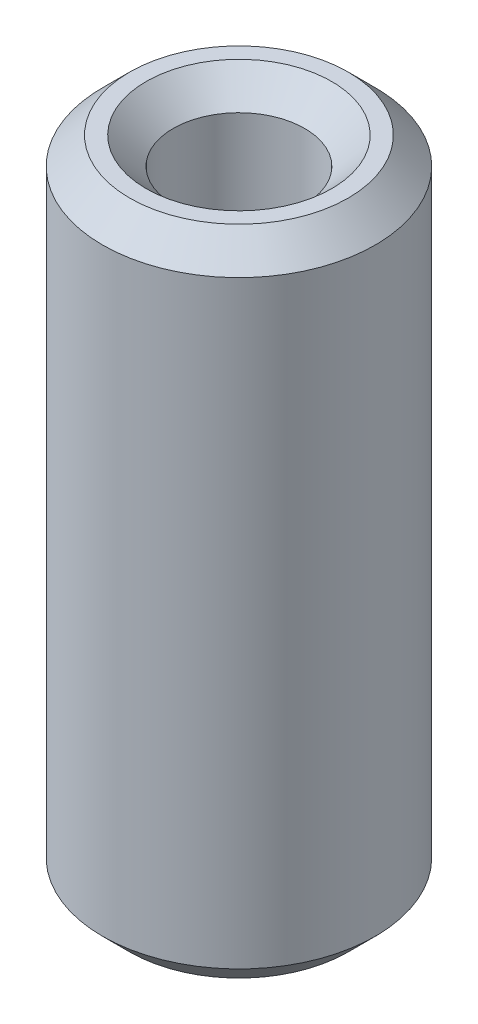
ISO-10303-21;
HEADER;
FILE_DESCRIPTION(('STEP AP214'),'2;1');
FILE_NAME('part.step','',(''),(''),'','','');
FILE_SCHEMA(('AUTOMOTIVE_DESIGN { 1 0 10303 214 1 1 1 1 }'));
ENDSEC;
DATA;
#1=APPLICATION_CONTEXT('core data for automotive mechanical design processes');
#2=APPLICATION_PROTOCOL_DEFINITION('international standard','automotive_design',2000,#1);
#3=PRODUCT_CONTEXT('',#1,'mechanical');
#4=PRODUCT('Part','Part','',(#3));
#5=PRODUCT_RELATED_PRODUCT_CATEGORY('part','',(#4));
#6=PRODUCT_DEFINITION_FORMATION('','',#4);
#7=PRODUCT_DEFINITION_CONTEXT('part definition',#1,'design');
#8=PRODUCT_DEFINITION('design','',#6,#7);
#9=PRODUCT_DEFINITION_SHAPE('','',#8);
#10=(LENGTH_UNIT() NAMED_UNIT(*) SI_UNIT(.MILLI.,.METRE.));
#11=(NAMED_UNIT(*) PLANE_ANGLE_UNIT() SI_UNIT($,.RADIAN.));
#12=(NAMED_UNIT(*) SI_UNIT($,.STERADIAN.) SOLID_ANGLE_UNIT());
#13=UNCERTAINTY_MEASURE_WITH_UNIT(LENGTH_MEASURE(1.E-05),#10,'distance_accuracy_value','');
#14=(GEOMETRIC_REPRESENTATION_CONTEXT(3) GLOBAL_UNCERTAINTY_ASSIGNED_CONTEXT((#13)) GLOBAL_UNIT_ASSIGNED_CONTEXT((#10,
#11,#12)) REPRESENTATION_CONTEXT('',''));
#15=CARTESIAN_POINT('',(0.,0.,0.));
#16=DIRECTION('',(0.,0.,1.));
#17=DIRECTION('',(1.,0.,0.));
#18=AXIS2_PLACEMENT_3D('',#15,#16,#17);
#19=CARTESIAN_POINT('',(0.,47.8930328423497,0.));
#20=DIRECTION('',(0.,-1.,0.));
#21=DIRECTION('',(0.,0.,-1.));
#22=AXIS2_PLACEMENT_3D('',#19,#20,#21);
#23=CYLINDRICAL_SURFACE('',#22,10.);
#24=CARTESIAN_POINT('',(0.,1.98736355204662,0.));
#25=DIRECTION('',(0.,1.,0.));
#26=DIRECTION('',(0.,0.,1.));
#27=AXIS2_PLACEMENT_3D('',#24,#25,#26);
#28=CIRCLE('',#27,10.);
#29=CARTESIAN_POINT('',(0.,1.98736355204662,10.));
#30=VERTEX_POINT('',#29);
#31=EDGE_CURVE('E10',#30,#30,#28,.T.);
#32=ORIENTED_EDGE('',*,*,#31,.T.);
#33=EDGE_LOOP('',(#32));
#34=FACE_BOUND('',#33,.T.);
#35=CARTESIAN_POINT('',(0.,45.9056692903031,0.));
#36=DIRECTION('',(0.,1.,0.));
#37=DIRECTION('',(0.,0.,1.));
#38=AXIS2_PLACEMENT_3D('',#35,#36,#37);
#39=CIRCLE('',#38,10.);
#40=CARTESIAN_POINT('',(0.,45.9056692903031,10.));
#41=VERTEX_POINT('',#40);
#42=EDGE_CURVE('E50',#41,#41,#39,.F.);
#43=ORIENTED_EDGE('',*,*,#42,.T.);
#44=EDGE_LOOP('',(#43));
#45=FACE_BOUND('',#44,.T.);
#46=ADVANCED_FACE('F39',(#34,#45),#23,.T.);
#47=CARTESIAN_POINT('',(0.,47.8930328423497,0.));
#48=DIRECTION('',(0.,1.,0.));
#49=DIRECTION('',(0.,0.,1.));
#50=AXIS2_PLACEMENT_3D('',#47,#48,#49);
#51=PLANE('',#50);
#52=CARTESIAN_POINT('',(0.,47.8930328423497,0.));
#53=DIRECTION('',(0.,1.,0.));
#54=DIRECTION('',(0.,0.,1.));
#55=AXIS2_PLACEMENT_3D('',#52,#53,#54);
#56=CIRCLE('',#55,6.80934280985178);
#57=CARTESIAN_POINT('',(0.,47.8930328423497,6.80934280985178));
#58=VERTEX_POINT('',#57);
#59=EDGE_CURVE('E58',#58,#58,#56,.F.);
#60=ORIENTED_EDGE('',*,*,#59,.T.);
#61=EDGE_LOOP('',(#60));
#62=FACE_BOUND('',#61,.T.);
#63=CARTESIAN_POINT('',(0.,47.8930328423497,0.));
#64=DIRECTION('',(0.,1.,0.));
#65=DIRECTION('',(0.,0.,1.));
#66=AXIS2_PLACEMENT_3D('',#63,#64,#65);
#67=CIRCLE('',#66,8.01263644795339);
#68=CARTESIAN_POINT('',(0.,47.8930328423497,8.01263644795339));
#69=VERTEX_POINT('',#68);
#70=EDGE_CURVE('E61',#69,#69,#67,.T.);
#71=ORIENTED_EDGE('',*,*,#70,.T.);
#72=EDGE_LOOP('',(#71));
#73=FACE_BOUND('',#72,.T.);
#74=ADVANCED_FACE('F88',(#62,#73),#51,.T.);
#75=CARTESIAN_POINT('',(0.,0.,0.));
#76=DIRECTION('',(0.,1.,0.));
#77=DIRECTION('',(0.,0.,1.));
#78=AXIS2_PLACEMENT_3D('',#75,#76,#77);
#79=PLANE('',#78);
#80=CARTESIAN_POINT('',(0.,0.,0.));
#81=DIRECTION('',(0.,1.,0.));
#82=DIRECTION('',(0.,0.,1.));
#83=AXIS2_PLACEMENT_3D('',#80,#81,#82);
#84=CIRCLE('',#83,6.80934280985177);
#85=CARTESIAN_POINT('',(0.,0.,6.80934280985177));
#86=VERTEX_POINT('',#85);
#87=EDGE_CURVE('E51',#86,#86,#84,.T.);
#88=ORIENTED_EDGE('',*,*,#87,.T.);
#89=EDGE_LOOP('',(#88));
#90=FACE_BOUND('',#89,.T.);
#91=CARTESIAN_POINT('',(0.,0.,0.));
#92=DIRECTION('',(0.,1.,0.));
#93=DIRECTION('',(0.,0.,1.));
#94=AXIS2_PLACEMENT_3D('',#91,#92,#93);
#95=CIRCLE('',#94,8.01263644795337);
#96=CARTESIAN_POINT('',(0.,0.,8.01263644795337));
#97=VERTEX_POINT('',#96);
#98=EDGE_CURVE('E54',#97,#97,#95,.F.);
#99=ORIENTED_EDGE('',*,*,#98,.T.);
#100=EDGE_LOOP('',(#99));
#101=FACE_BOUND('',#100,.T.);
#102=ADVANCED_FACE('F83',(#90,#101),#79,.F.);
#103=CARTESIAN_POINT('',(0.,47.8930328423497,0.));
#104=DIRECTION('',(0.,-1.,0.));
#105=DIRECTION('',(0.,0.,-1.));
#106=AXIS2_PLACEMENT_3D('',#103,#104,#105);
#107=CYLINDRICAL_SURFACE('',#106,4.82197925780515);
#108=CARTESIAN_POINT('',(0.,45.9056692903031,0.));
#109=DIRECTION('',(0.,1.,0.));
#110=DIRECTION('',(0.,0.,1.));
#111=AXIS2_PLACEMENT_3D('',#108,#109,#110);
#112=CIRCLE('',#111,4.82197925780515);
#113=CARTESIAN_POINT('',(0.,45.9056692903031,4.82197925780515));
#114=VERTEX_POINT('',#113);
#115=EDGE_CURVE('E67',#114,#114,#112,.T.);
#116=ORIENTED_EDGE('',*,*,#115,.T.);
#117=EDGE_LOOP('',(#116));
#118=FACE_BOUND('',#117,.T.);
#119=CARTESIAN_POINT('',(0.,1.98736355204662,0.));
#120=DIRECTION('',(0.,1.,0.));
#121=DIRECTION('',(0.,0.,1.));
#122=AXIS2_PLACEMENT_3D('',#119,#120,#121);
#123=CIRCLE('',#122,4.82197925780515);
#124=CARTESIAN_POINT('',(0.,1.98736355204662,4.82197925780515));
#125=VERTEX_POINT('',#124);
#126=EDGE_CURVE('E69',#125,#125,#123,.F.);
#127=ORIENTED_EDGE('',*,*,#126,.T.);
#128=EDGE_LOOP('',(#127));
#129=FACE_BOUND('',#128,.T.);
#130=ADVANCED_FACE('F71',(#118,#129),#107,.F.);
#131=CARTESIAN_POINT('',(0.,45.9056692903031,0.));
#132=DIRECTION('',(0.,1.,0.));
#133=DIRECTION('',(0.,0.,1.));
#134=AXIS2_PLACEMENT_3D('',#131,#132,#133);
#135=CONICAL_SURFACE('',#134,4.82197925780515,0.785398163397451);
#136=ORIENTED_EDGE('',*,*,#59,.F.);
#137=EDGE_LOOP('',(#136));
#138=FACE_BOUND('',#137,.T.);
#139=ORIENTED_EDGE('',*,*,#115,.F.);
#140=EDGE_LOOP('',(#139));
#141=FACE_BOUND('',#140,.T.);
#142=ADVANCED_FACE('F77',(#138,#141),#135,.F.);
#143=CARTESIAN_POINT('',(0.,0.,0.));
#144=DIRECTION('',(0.,-1.,0.));
#145=DIRECTION('',(0.,0.,-1.));
#146=AXIS2_PLACEMENT_3D('',#143,#144,#145);
#147=CONICAL_SURFACE('',#146,6.80934280985177,0.785398163397446);
#148=ORIENTED_EDGE('',*,*,#126,.F.);
#149=EDGE_LOOP('',(#148));
#150=FACE_BOUND('',#149,.T.);
#151=ORIENTED_EDGE('',*,*,#87,.F.);
#152=EDGE_LOOP('',(#151));
#153=FACE_BOUND('',#152,.T.);
#154=ADVANCED_FACE('F73',(#150,#153),#147,.F.);
#155=CARTESIAN_POINT('',(0.,1.98736355204662,0.));
#156=DIRECTION('',(0.,1.,0.));
#157=DIRECTION('',(0.,0.,1.));
#158=AXIS2_PLACEMENT_3D('',#155,#156,#157);
#159=CONICAL_SURFACE('',#158,10.,0.785398163397452);
#160=ORIENTED_EDGE('',*,*,#98,.F.);
#161=EDGE_LOOP('',(#160));
#162=FACE_BOUND('',#161,.T.);
#163=ORIENTED_EDGE('',*,*,#31,.F.);
#164=EDGE_LOOP('',(#163));
#165=FACE_BOUND('',#164,.T.);
#166=ADVANCED_FACE('F76',(#162,#165),#159,.T.);
#167=CARTESIAN_POINT('',(0.,47.8930328423497,0.));
#168=DIRECTION('',(0.,-1.,0.));
#169=DIRECTION('',(0.,0.,-1.));
#170=AXIS2_PLACEMENT_3D('',#167,#168,#169);
#171=CONICAL_SURFACE('',#170,8.01263644795339,0.785398163397445);
#172=ORIENTED_EDGE('',*,*,#42,.F.);
#173=EDGE_LOOP('',(#172));
#174=FACE_BOUND('',#173,.T.);
#175=ORIENTED_EDGE('',*,*,#70,.F.);
#176=EDGE_LOOP('',(#175));
#177=FACE_BOUND('',#176,.T.);
#178=ADVANCED_FACE('F45',(#174,#177),#171,.T.);
#179=CLOSED_SHELL('',(#46,#74,#102,#130,#142,#154,#166,#178));
#180=MANIFOLD_SOLID_BREP('B2',#179);
#181=ADVANCED_BREP_SHAPE_REPRESENTATION('',(#18,#180),#14);
#182=SHAPE_DEFINITION_REPRESENTATION(#9,#181);
ENDSEC;
END-ISO-10303-21;
